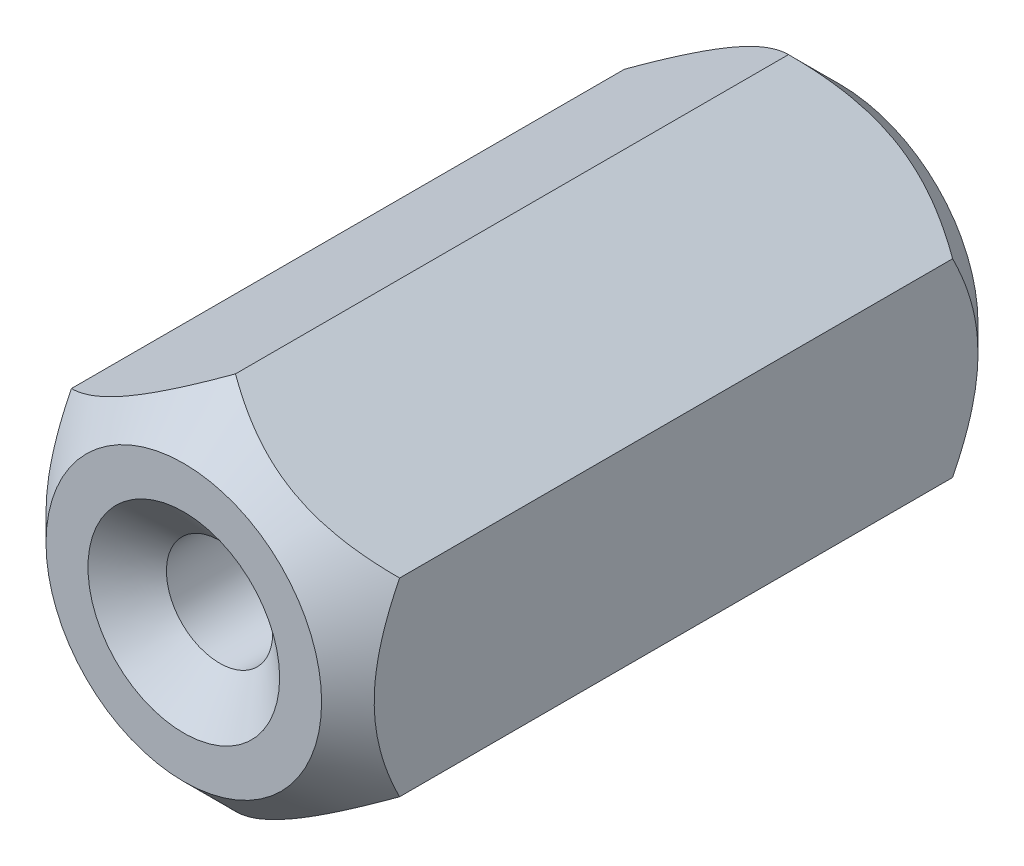
ISO-10303-21;
HEADER;
FILE_DESCRIPTION(('STEP AP214'),'2;1');
FILE_NAME('part.step','',(''),(''),'','','');
FILE_SCHEMA(('AUTOMOTIVE_DESIGN { 1 0 10303 214 1 1 1 1 }'));
ENDSEC;
DATA;
#1=APPLICATION_CONTEXT('core data for automotive mechanical design processes');
#2=APPLICATION_PROTOCOL_DEFINITION('international standard','automotive_design',2000,#1);
#3=PRODUCT_CONTEXT('',#1,'mechanical');
#4=PRODUCT('Part','Part','',(#3));
#5=PRODUCT_RELATED_PRODUCT_CATEGORY('part','',(#4));
#6=PRODUCT_DEFINITION_FORMATION('','',#4);
#7=PRODUCT_DEFINITION_CONTEXT('part definition',#1,'design');
#8=PRODUCT_DEFINITION('design','',#6,#7);
#9=PRODUCT_DEFINITION_SHAPE('','',#8);
#10=(LENGTH_UNIT() NAMED_UNIT(*) SI_UNIT(.MILLI.,.METRE.));
#11=(NAMED_UNIT(*) PLANE_ANGLE_UNIT() SI_UNIT($,.RADIAN.));
#12=(NAMED_UNIT(*) SI_UNIT($,.STERADIAN.) SOLID_ANGLE_UNIT());
#13=UNCERTAINTY_MEASURE_WITH_UNIT(LENGTH_MEASURE(1.E-05),#10,'distance_accuracy_value','');
#14=(GEOMETRIC_REPRESENTATION_CONTEXT(3) GLOBAL_UNCERTAINTY_ASSIGNED_CONTEXT((#13)) GLOBAL_UNIT_ASSIGNED_CONTEXT((#10,
#11,#12)) REPRESENTATION_CONTEXT('',''));
#15=CARTESIAN_POINT('',(0.,0.,0.));
#16=DIRECTION('',(0.,0.,1.));
#17=DIRECTION('',(1.,0.,0.));
#18=AXIS2_PLACEMENT_3D('',#15,#16,#17);
#19=CARTESIAN_POINT('',(0.,-3.66617420935412,-6.35));
#20=DIRECTION('',(0.5,-0.866025403784439,0.));
#21=DIRECTION('',(0.866025403784439,0.5,0.));
#22=AXIS2_PLACEMENT_3D('',#19,#20,#21);
#23=PLANE('',#22);
#24=CARTESIAN_POINT('',(3.1752,-1.83297163462322,-5.34988452449106));
#25=CARTESIAN_POINT('',(3.06606165005017,-1.89598269034567,-5.41284101630822));
#26=CARTESIAN_POINT('',(2.95509837192205,-1.9600473688431,-5.47209989576525));
#27=CARTESIAN_POINT('',(2.72883215365405,-2.09068223086865,-5.58060134426944));
#28=CARTESIAN_POINT('',(2.61350769674773,-2.15726483710766,-5.62978354606129));
#29=CARTESIAN_POINT('',(2.38096147751937,-2.29152545937819,-5.71403354112599));
#30=CARTESIAN_POINT('',(2.26379893371885,-2.35916928558036,-5.74931308550055));
#31=CARTESIAN_POINT('',(2.02689455535371,-2.49594609220167,-5.80366842986518));
#32=CARTESIAN_POINT('',(1.90715995735644,-2.56507489458671,-5.82278480247036));
#33=CARTESIAN_POINT('',(1.70080208124841,-2.68421566990708,-5.84003286937675));
#34=CARTESIAN_POINT('',(1.61444529227084,-2.73407378526963,-5.84258606638617));
#35=CARTESIAN_POINT('',(1.44187218347527,-2.83370891608764,-5.83828372687673));
#36=CARTESIAN_POINT('',(1.35565592350718,-2.88348589698874,-5.83142489197855));
#37=CARTESIAN_POINT('',(1.18404020841286,-2.98256827629562,-5.80869011669629));
#38=CARTESIAN_POINT('',(1.09864177574671,-3.03187308438379,-5.79280409031271));
#39=CARTESIAN_POINT('',(0.929311596694509,-3.12963590884151,-5.75288201600204));
#40=CARTESIAN_POINT('',(0.845379738380234,-3.17809398983284,-5.72884659291482));
#41=CARTESIAN_POINT('',(0.696376420715867,-3.26412109539651,-5.67939476558282));
#42=CARTESIAN_POINT('',(0.630975148808252,-3.30188053733772,-5.655278280699));
#43=CARTESIAN_POINT('',(0.50134674979488,-3.37672152840271,-5.60315853286284));
#44=CARTESIAN_POINT('',(0.437119658558265,-3.41380305681743,-5.57515515139647));
#45=CARTESIAN_POINT('',(0.310041965487392,-3.4871713971199,-5.51588943445548));
#46=CARTESIAN_POINT('',(0.247187749251269,-3.52346029578353,-5.48463734664579));
#47=CARTESIAN_POINT('',(0.122643379151904,-3.59536602138645,-5.41928465560806));
#48=CARTESIAN_POINT('',(0.0609525390212889,-3.63098324454239,-5.38518580048145));
#49=CARTESIAN_POINT('',(-0.000200000000000083,-3.66628967940796,-5.34988452449106));
#50=B_SPLINE_CURVE_WITH_KNOTS('',3,(#24,#25,#26,#27,#28,#29,#30,#31,#32,#33,#34,#35,#36,#37,#38,
#39,#40,#41,#42,#43,#44,#45,#46,#47,#48,#49),.UNSPECIFIED.,.F.,.F.,(4,2,2,2,2,2,2,2,2,2,2,2,4),
(0.,0.422910572436809,0.848285055427811,1.26690402276128,1.68446903107507,1.98329272958353,
2.28222117546891,2.58148426995467,2.88072442418454,3.11844134429547,3.35616551414406,
3.59316134346767,3.83001269744429),.UNSPECIFIED.);
#51=CARTESIAN_POINT('',(3.175,-1.83308710467706,-5.35));
#52=VERTEX_POINT('',#51);
#53=CARTESIAN_POINT('',(0.,-3.66617420935412,-5.35));
#54=VERTEX_POINT('',#53);
#55=EDGE_CURVE('E197',#52,#54,#50,.T.);
#56=ORIENTED_EDGE('',*,*,#55,.F.);
#57=DIRECTION('',(0.,0.,1.));
#58=VECTOR('',#57,1.);
#59=CARTESIAN_POINT('',(3.175,-1.83308710467706,-6.35));
#60=LINE('',#59,#58);
#61=CARTESIAN_POINT('',(3.175,-1.83308710467706,5.35));
#62=VERTEX_POINT('',#61);
#63=EDGE_CURVE('E38',#52,#62,#60,.T.);
#64=ORIENTED_EDGE('',*,*,#63,.T.);
#65=CARTESIAN_POINT('',(-0.000200000000000596,-3.66628967940796,5.34988452449106));
#66=CARTESIAN_POINT('',(0.108938349949826,-3.60327862368552,5.41284101630822));
#67=CARTESIAN_POINT('',(0.219901628077946,-3.53921394518808,5.47209989576525));
#68=CARTESIAN_POINT('',(0.446167846345949,-3.40857908316253,5.58060134426944));
#69=CARTESIAN_POINT('',(0.561492303252266,-3.34199647692352,5.62978354606129));
#70=CARTESIAN_POINT('',(0.79403852248063,-3.207735854653,5.714033541126));
#71=CARTESIAN_POINT('',(0.911201066281155,-3.14009202845082,5.74931308550055));
#72=CARTESIAN_POINT('',(1.14810544464629,-3.00331522182951,5.80366842986518));
#73=CARTESIAN_POINT('',(1.26784004264356,-2.93418641944448,5.82278480247036));
#74=CARTESIAN_POINT('',(1.47419791875159,-2.81504564412411,5.84003286937675));
#75=CARTESIAN_POINT('',(1.56055470772916,-2.76518752876155,5.84258606638617));
#76=CARTESIAN_POINT('',(1.73312781652473,-2.66555239794354,5.83828372687673));
#77=CARTESIAN_POINT('',(1.81934407649282,-2.61577541704245,5.83142489197855));
#78=CARTESIAN_POINT('',(1.99095979158714,-2.51669303773557,5.80869011669629));
#79=CARTESIAN_POINT('',(2.07635822425329,-2.46738822964739,5.79280409031271));
#80=CARTESIAN_POINT('',(2.24568840330549,-2.36962540518968,5.75288201600204));
#81=CARTESIAN_POINT('',(2.32962026161977,-2.32116732419835,5.72884659291482));
#82=CARTESIAN_POINT('',(2.47862357928413,-2.23514021863468,5.67939476558282));
#83=CARTESIAN_POINT('',(2.54402485119175,-2.19738077669347,5.655278280699));
#84=CARTESIAN_POINT('',(2.67365325020512,-2.12253978562848,5.60315853286284));
#85=CARTESIAN_POINT('',(2.73788034144173,-2.08545825721375,5.57515515139647));
#86=CARTESIAN_POINT('',(2.86495803451261,-2.01208991691129,5.51588943445548));
#87=CARTESIAN_POINT('',(2.92781225074873,-1.97580101824766,5.48463734664579));
#88=CARTESIAN_POINT('',(3.0523566208481,-1.90389529264474,5.41928465560806));
#89=CARTESIAN_POINT('',(3.11404746097871,-1.8682780694888,5.38518580048145));
#90=CARTESIAN_POINT('',(3.1752,-1.83297163462322,5.34988452449105));
#91=B_SPLINE_CURVE_WITH_KNOTS('',3,(#65,#66,#67,#68,#69,#70,#71,#72,#73,#74,#75,#76,#77,#78,#79,
#80,#81,#82,#83,#84,#85,#86,#87,#88,#89,#90),.UNSPECIFIED.,.F.,.F.,(4,2,2,2,2,2,2,2,2,2,2,2,4),
(0.,0.422910572436811,0.848285055427812,1.26690402276128,1.68446903107507,1.98329272958353,
2.28222117546892,2.58148426995467,2.88072442418454,3.11844134429548,3.35616551414406,
3.59316134346767,3.83001269744429),.UNSPECIFIED.);
#92=CARTESIAN_POINT('',(0.,-3.66617420935412,5.35));
#93=VERTEX_POINT('',#92);
#94=EDGE_CURVE('E118',#93,#62,#91,.T.);
#95=ORIENTED_EDGE('',*,*,#94,.F.);
#96=DIRECTION('',(0.,0.,1.));
#97=VECTOR('',#96,1.);
#98=CARTESIAN_POINT('',(0.,-3.66617420935412,-6.35));
#99=LINE('',#98,#97);
#100=EDGE_CURVE('E11',#54,#93,#99,.T.);
#101=ORIENTED_EDGE('',*,*,#100,.F.);
#102=EDGE_LOOP('',(#56,#64,#95,#101));
#103=FACE_BOUND('',#102,.T.);
#104=ADVANCED_FACE('F34',(#103),#23,.T.);
#105=CARTESIAN_POINT('',(-3.175,-1.83308710467706,-6.35));
#106=DIRECTION('',(-0.5,-0.866025403784439,0.));
#107=DIRECTION('',(0.866025403784439,-0.5,0.));
#108=AXIS2_PLACEMENT_3D('',#105,#106,#107);
#109=PLANE('',#108);
#110=CARTESIAN_POINT('',(0.000199999999999404,-3.66628967940796,-5.34988452449106));
#111=CARTESIAN_POINT('',(-0.108938349949827,-3.60327862368552,-5.41284101630822));
#112=CARTESIAN_POINT('',(-0.219901628077947,-3.53921394518808,-5.47209989576526));
#113=CARTESIAN_POINT('',(-0.44616784634595,-3.40857908316253,-5.58060134426944));
#114=CARTESIAN_POINT('',(-0.561492303252266,-3.34199647692352,-5.62978354606129));
#115=CARTESIAN_POINT('',(-0.794038522480631,-3.207735854653,-5.71403354112599));
#116=CARTESIAN_POINT('',(-0.911201066281155,-3.14009202845082,-5.74931308550055));
#117=CARTESIAN_POINT('',(-1.14810544464629,-3.00331522182951,-5.80366842986518));
#118=CARTESIAN_POINT('',(-1.26784004264356,-2.93418641944448,-5.82278480247036));
#119=CARTESIAN_POINT('',(-1.47419791875159,-2.81504564412411,-5.84003286937675));
#120=CARTESIAN_POINT('',(-1.56055470772916,-2.76518752876155,-5.84258606638617));
#121=CARTESIAN_POINT('',(-1.73312781652473,-2.66555239794354,-5.83828372687673));
#122=CARTESIAN_POINT('',(-1.81934407649282,-2.61577541704245,-5.83142489197855));
#123=CARTESIAN_POINT('',(-1.99095979158714,-2.51669303773556,-5.80869011669629));
#124=CARTESIAN_POINT('',(-2.07635822425329,-2.46738822964739,-5.79280409031272));
#125=CARTESIAN_POINT('',(-2.24568840330549,-2.36962540518968,-5.75288201600204));
#126=CARTESIAN_POINT('',(-2.32962026161977,-2.32116732419835,-5.72884659291482));
#127=CARTESIAN_POINT('',(-2.47862357928413,-2.23514021863468,-5.67939476558283));
#128=CARTESIAN_POINT('',(-2.54402485119175,-2.19738077669347,-5.655278280699));
#129=CARTESIAN_POINT('',(-2.67365325020512,-2.12253978562848,-5.60315853286284));
#130=CARTESIAN_POINT('',(-2.73788034144173,-2.08545825721375,-5.57515515139647));
#131=CARTESIAN_POINT('',(-2.86495803451261,-2.01208991691129,-5.51588943445549));
#132=CARTESIAN_POINT('',(-2.92781225074873,-1.97580101824766,-5.48463734664579));
#133=CARTESIAN_POINT('',(-3.0523566208481,-1.90389529264474,-5.41928465560807));
#134=CARTESIAN_POINT('',(-3.11404746097871,-1.86827806948879,-5.38518580048146));
#135=CARTESIAN_POINT('',(-3.1752,-1.83297163462322,-5.34988452449106));
#136=B_SPLINE_CURVE_WITH_KNOTS('',3,(#110,#111,#112,#113,#114,#115,#116,#117,#118,#119,#120,
#121,#122,#123,#124,#125,#126,#127,#128,#129,#130,#131,#132,#133,#134,#135),.UNSPECIFIED.,.F.,
.F.,(4,2,2,2,2,2,2,2,2,2,2,2,4),(0.,0.42291057243681,0.848285055427812,1.26690402276128,
1.68446903107507,1.98329272958353,2.28222117546892,2.58148426995467,2.88072442418454,
3.11844134429547,3.35616551414406,3.59316134346767,3.83001269744429),.UNSPECIFIED.);
#137=CARTESIAN_POINT('',(-3.175,-1.83308710467706,-5.35));
#138=VERTEX_POINT('',#137);
#139=EDGE_CURVE('E93',#54,#138,#136,.T.);
#140=ORIENTED_EDGE('',*,*,#139,.F.);
#141=ORIENTED_EDGE('',*,*,#100,.T.);
#142=CARTESIAN_POINT('',(-3.1752,-1.83297163462322,5.34988452449106));
#143=CARTESIAN_POINT('',(-3.06606165005017,-1.89598269034567,5.41284101630822));
#144=CARTESIAN_POINT('',(-2.95509837192205,-1.9600473688431,5.47209989576525));
#145=CARTESIAN_POINT('',(-2.72883215365405,-2.09068223086865,5.58060134426944));
#146=CARTESIAN_POINT('',(-2.61350769674773,-2.15726483710766,5.62978354606129));
#147=CARTESIAN_POINT('',(-2.38096147751937,-2.29152545937819,5.714033541126));
#148=CARTESIAN_POINT('',(-2.26379893371885,-2.35916928558036,5.74931308550055));
#149=CARTESIAN_POINT('',(-2.02689455535372,-2.49594609220167,5.80366842986518));
#150=CARTESIAN_POINT('',(-1.90715995735644,-2.56507489458671,5.82278480247036));
#151=CARTESIAN_POINT('',(-1.70080208124841,-2.68421566990708,5.84003286937675));
#152=CARTESIAN_POINT('',(-1.61444529227084,-2.73407378526963,5.84258606638617));
#153=CARTESIAN_POINT('',(-1.44187218347528,-2.83370891608764,5.83828372687673));
#154=CARTESIAN_POINT('',(-1.35565592350719,-2.88348589698874,5.83142489197855));
#155=CARTESIAN_POINT('',(-1.18404020841286,-2.98256827629562,5.80869011669629));
#156=CARTESIAN_POINT('',(-1.09864177574671,-3.03187308438379,5.79280409031272));
#157=CARTESIAN_POINT('',(-0.929311596694513,-3.12963590884151,5.75288201600204));
#158=CARTESIAN_POINT('',(-0.845379738380237,-3.17809398983284,5.72884659291482));
#159=CARTESIAN_POINT('',(-0.696376420715871,-3.26412109539651,5.67939476558283));
#160=CARTESIAN_POINT('',(-0.630975148808255,-3.30188053733771,5.655278280699));
#161=CARTESIAN_POINT('',(-0.501346749794882,-3.3767215284027,5.60315853286284));
#162=CARTESIAN_POINT('',(-0.437119658558267,-3.41380305681743,5.57515515139647));
#163=CARTESIAN_POINT('',(-0.310041965487393,-3.4871713971199,5.51588943445549));
#164=CARTESIAN_POINT('',(-0.247187749251271,-3.52346029578352,5.48463734664579));
#165=CARTESIAN_POINT('',(-0.122643379151905,-3.59536602138645,5.41928465560806));
#166=CARTESIAN_POINT('',(-0.0609525390212896,-3.63098324454239,5.38518580048145));
#167=CARTESIAN_POINT('',(0.000199999999999347,-3.66628967940796,5.34988452449106));
#168=B_SPLINE_CURVE_WITH_KNOTS('',3,(#142,#143,#144,#145,#146,#147,#148,#149,#150,#151,#152,
#153,#154,#155,#156,#157,#158,#159,#160,#161,#162,#163,#164,#165,#166,#167),.UNSPECIFIED.,.F.,
.F.,(4,2,2,2,2,2,2,2,2,2,2,2,4),(0.,0.422910572436809,0.84828505542781,1.26690402276128,
1.68446903107507,1.98329272958352,2.28222117546891,2.58148426995467,2.88072442418453,
3.11844134429547,3.35616551414406,3.59316134346767,3.83001269744429),.UNSPECIFIED.);
#169=CARTESIAN_POINT('',(-3.175,-1.83308710467706,5.35));
#170=VERTEX_POINT('',#169);
#171=EDGE_CURVE('E119',#170,#93,#168,.T.);
#172=ORIENTED_EDGE('',*,*,#171,.F.);
#173=DIRECTION('',(0.,0.,1.));
#174=VECTOR('',#173,1.);
#175=CARTESIAN_POINT('',(-3.175,-1.83308710467706,-6.35));
#176=LINE('',#175,#174);
#177=EDGE_CURVE('E43',#138,#170,#176,.T.);
#178=ORIENTED_EDGE('',*,*,#177,.F.);
#179=EDGE_LOOP('',(#140,#141,#172,#178));
#180=FACE_BOUND('',#179,.T.);
#181=ADVANCED_FACE('F178',(#180),#109,.T.);
#182=CARTESIAN_POINT('',(-3.175,1.83308710467706,-6.35));
#183=DIRECTION('',(-1.,0.,0.));
#184=DIRECTION('',(0.,-1.,0.));
#185=AXIS2_PLACEMENT_3D('',#182,#183,#184);
#186=PLANE('',#185);
#187=CARTESIAN_POINT('',(-3.175,-3.62314366162436,-4.19872727215091));
#188=CARTESIAN_POINT('',(-3.175,-3.53477477471413,-4.26517330066197));
#189=CARTESIAN_POINT('',(-3.175,-3.44590747401783,-4.33096732929088));
#190=CARTESIAN_POINT('',(-3.175,-3.26698086109358,-4.46096065674581));
#191=CARTESIAN_POINT('',(-3.175,-3.17692125186334,-4.52515954631578));
#192=CARTESIAN_POINT('',(-3.175,-2.9947562299698,-4.65212801376402));
#193=CARTESIAN_POINT('',(-3.175,-2.90264037042889,-4.71488265440275));
#194=CARTESIAN_POINT('',(-3.175,-2.71683951537136,-4.8380168325571));
#195=CARTESIAN_POINT('',(-3.175,-2.62315463201829,-4.89839653882316));
#196=CARTESIAN_POINT('',(-3.175,-2.42867521304995,-5.01955311497214));
#197=CARTESIAN_POINT('',(-3.175,-2.327776197965,-5.08016312895682));
#198=CARTESIAN_POINT('',(-3.175,-2.1236266416231,-5.19734891241029));
#199=CARTESIAN_POINT('',(-3.175,-2.02037573570296,-5.25392405057173));
#200=CARTESIAN_POINT('',(-3.175,-1.81153946353305,-5.36181638181168));
#201=CARTESIAN_POINT('',(-3.175,-1.70596214797143,-5.41314903574252));
#202=CARTESIAN_POINT('',(-3.175,-1.49194968831593,-5.50940753599678));
#203=CARTESIAN_POINT('',(-3.175,-1.38351585328126,-5.55433625855787));
#204=CARTESIAN_POINT('',(-3.175,-1.17206906194383,-5.63305402653428));
#205=CARTESIAN_POINT('',(-3.175,-1.06927808219159,-5.6674331189904));
#206=CARTESIAN_POINT('',(-3.175,-0.861249989752693,-5.72794018821902));
#207=CARTESIAN_POINT('',(-3.175,-0.756012706347597,-5.75406758726936));
#208=CARTESIAN_POINT('',(-3.175,-0.545455116385145,-5.79628154980003));
#209=CARTESIAN_POINT('',(-3.175,-0.440169465308187,-5.81253816718227));
#210=CARTESIAN_POINT('',(-3.175,-0.228508692793317,-5.83470019179704));
#211=CARTESIAN_POINT('',(-3.175,-0.122133754622792,-5.84060731241113));
#212=CARTESIAN_POINT('',(-3.175,0.0869577968377134,-5.84164473816365));
#213=CARTESIAN_POINT('',(-3.175,0.189672720284837,-5.83714340706931));
#214=CARTESIAN_POINT('',(-3.175,0.394206632826209,-5.81841780352249));
#215=CARTESIAN_POINT('',(-3.175,0.496025532914315,-5.80419257595037));
#216=CARTESIAN_POINT('',(-3.175,0.699751411908735,-5.76654774602645));
#217=CARTESIAN_POINT('',(-3.175,0.80162922915897,-5.7429728022883));
#218=CARTESIAN_POINT('',(-3.175,1.00316901022372,-5.68787603830061));
#219=CARTESIAN_POINT('',(-3.175,1.10283116972946,-5.65635492293116));
#220=CARTESIAN_POINT('',(-3.175,1.30972972723242,-5.583139745003));
#221=CARTESIAN_POINT('',(-3.175,1.41671377003006,-5.54073954984725));
#222=CARTESIAN_POINT('',(-3.175,1.62788222750015,-5.4494455092361));
#223=CARTESIAN_POINT('',(-3.175,1.73206568079257,-5.40054946728032));
#224=CARTESIAN_POINT('',(-3.175,1.93816752656033,-5.2974201972936));
#225=CARTESIAN_POINT('',(-3.175,2.04007726416977,-5.24316981162604));
#226=CARTESIAN_POINT('',(-3.175,2.24154914453307,-5.13053481703511));
#227=CARTESIAN_POINT('',(-3.175,2.34111165997837,-5.07215087041164));
#228=CARTESIAN_POINT('',(-3.175,2.53328789139579,-4.95505822864378));
#229=CARTESIAN_POINT('',(-3.175,2.62600050272272,-4.89651098750221));
#230=CARTESIAN_POINT('',(-3.175,2.80983442239984,-4.77696182904577));
#231=CARTESIAN_POINT('',(-3.175,2.90095560921207,-4.71595972541707));
#232=CARTESIAN_POINT('',(-3.175,3.08107470813498,-4.59244540123562));
#233=CARTESIAN_POINT('',(-3.175,3.1700838687153,-4.52994952545103));
#234=CARTESIAN_POINT('',(-3.175,3.34688695470738,-4.40331054967444));
#235=CARTESIAN_POINT('',(-3.175,3.43468120733686,-4.33916790704841));
#236=CARTESIAN_POINT('',(-3.175,3.52196693533842,-4.27435218679602));
#237=B_SPLINE_CURVE_WITH_KNOTS('',3,(#187,#188,#189,#190,#191,#192,#193,#194,#195,#196,#197,
#198,#199,#200,#201,#202,#203,#204,#205,#206,#207,#208,#209,#210,#211,#212,#213,#214,#215,#216,
#217,#218,#219,#220,#221,#222,#223,#224,#225,#226,#227,#228,#229,#230,#231,#232,#233,#234,#235,
#236),.UNSPECIFIED.,.F.,.F.,(4,2,2,2,2,2,2,2,2,2,2,2,2,2,2,2,2,2,2,2,2,2,2,2,4),(0.,
0.331695086033258,0.663474412411204,0.997825593478522,1.33215297421855,1.68518935827853,
2.03828085871132,2.39029899374214,2.74215852308448,3.06703502033416,3.39193425797894,
3.71106436530982,4.03014163496714,4.33810010599997,4.64608883028139,4.9594247376372,
5.27273285971666,5.6177025492793,5.96278918493366,6.30901993384334,6.65519533292016,
6.98410375942931,7.31303719597191,7.63929174244195,7.96545663622253),.UNSPECIFIED.);
#238=CARTESIAN_POINT('',(-3.175,1.83308710467706,-5.35));
#239=VERTEX_POINT('',#238);
#240=EDGE_CURVE('E87',#138,#239,#237,.T.);
#241=ORIENTED_EDGE('',*,*,#240,.F.);
#242=ORIENTED_EDGE('',*,*,#177,.T.);
#243=CARTESIAN_POINT('',(-3.175,-3.62314366162436,4.19872727215091));
#244=CARTESIAN_POINT('',(-3.175,-3.53477477471413,4.26517330066197));
#245=CARTESIAN_POINT('',(-3.175,-3.44590747401783,4.33096732929088));
#246=CARTESIAN_POINT('',(-3.175,-3.26698086109358,4.46096065674581));
#247=CARTESIAN_POINT('',(-3.175,-3.17692125186334,4.52515954631578));
#248=CARTESIAN_POINT('',(-3.175,-2.9947562299698,4.65212801376402));
#249=CARTESIAN_POINT('',(-3.175,-2.90264037042889,4.71488265440275));
#250=CARTESIAN_POINT('',(-3.175,-2.71683951537136,4.8380168325571));
#251=CARTESIAN_POINT('',(-3.175,-2.62315463201829,4.89839653882316));
#252=CARTESIAN_POINT('',(-3.175,-2.42867521304995,5.01955311497214));
#253=CARTESIAN_POINT('',(-3.175,-2.327776197965,5.08016312895682));
#254=CARTESIAN_POINT('',(-3.175,-2.1236266416231,5.19734891241029));
#255=CARTESIAN_POINT('',(-3.175,-2.02037573570296,5.25392405057173));
#256=CARTESIAN_POINT('',(-3.175,-1.81153946353305,5.36181638181168));
#257=CARTESIAN_POINT('',(-3.175,-1.70596214797143,5.41314903574252));
#258=CARTESIAN_POINT('',(-3.175,-1.49194968831593,5.50940753599678));
#259=CARTESIAN_POINT('',(-3.175,-1.38351585328126,5.55433625855787));
#260=CARTESIAN_POINT('',(-3.175,-1.17206906194383,5.63305402653428));
#261=CARTESIAN_POINT('',(-3.175,-1.06927808219159,5.6674331189904));
#262=CARTESIAN_POINT('',(-3.175,-0.861249989752693,5.72794018821902));
#263=CARTESIAN_POINT('',(-3.175,-0.756012706347597,5.75406758726936));
#264=CARTESIAN_POINT('',(-3.175,-0.545455116385145,5.79628154980003));
#265=CARTESIAN_POINT('',(-3.175,-0.440169465308187,5.81253816718227));
#266=CARTESIAN_POINT('',(-3.175,-0.228508692793317,5.83470019179704));
#267=CARTESIAN_POINT('',(-3.175,-0.122133754622792,5.84060731241113));
#268=CARTESIAN_POINT('',(-3.175,0.0869577968377134,5.84164473816365));
#269=CARTESIAN_POINT('',(-3.175,0.189672720284837,5.83714340706931));
#270=CARTESIAN_POINT('',(-3.175,0.394206632826209,5.81841780352249));
#271=CARTESIAN_POINT('',(-3.175,0.496025532914315,5.80419257595037));
#272=CARTESIAN_POINT('',(-3.175,0.699751411908735,5.76654774602645));
#273=CARTESIAN_POINT('',(-3.175,0.80162922915897,5.7429728022883));
#274=CARTESIAN_POINT('',(-3.175,1.00316901022372,5.68787603830061));
#275=CARTESIAN_POINT('',(-3.175,1.10283116972946,5.65635492293116));
#276=CARTESIAN_POINT('',(-3.175,1.30972972723242,5.583139745003));
#277=CARTESIAN_POINT('',(-3.175,1.41671377003006,5.54073954984725));
#278=CARTESIAN_POINT('',(-3.175,1.62788222750015,5.4494455092361));
#279=CARTESIAN_POINT('',(-3.175,1.73206568079257,5.40054946728032));
#280=CARTESIAN_POINT('',(-3.175,1.93816752656033,5.2974201972936));
#281=CARTESIAN_POINT('',(-3.175,2.04007726416977,5.24316981162604));
#282=CARTESIAN_POINT('',(-3.175,2.24154914453307,5.13053481703511));
#283=CARTESIAN_POINT('',(-3.175,2.34111165997837,5.07215087041164));
#284=CARTESIAN_POINT('',(-3.175,2.53328789139579,4.95505822864378));
#285=CARTESIAN_POINT('',(-3.175,2.62600050272272,4.89651098750221));
#286=CARTESIAN_POINT('',(-3.175,2.80983442239984,4.77696182904577));
#287=CARTESIAN_POINT('',(-3.175,2.90095560921207,4.71595972541707));
#288=CARTESIAN_POINT('',(-3.175,3.08107470813498,4.59244540123562));
#289=CARTESIAN_POINT('',(-3.175,3.1700838687153,4.52994952545103));
#290=CARTESIAN_POINT('',(-3.175,3.34688695470738,4.40331054967444));
#291=CARTESIAN_POINT('',(-3.175,3.43468120733686,4.33916790704841));
#292=CARTESIAN_POINT('',(-3.175,3.52196693533842,4.27435218679602));
#293=B_SPLINE_CURVE_WITH_KNOTS('',3,(#243,#244,#245,#246,#247,#248,#249,#250,#251,#252,#253,
#254,#255,#256,#257,#258,#259,#260,#261,#262,#263,#264,#265,#266,#267,#268,#269,#270,#271,#272,
#273,#274,#275,#276,#277,#278,#279,#280,#281,#282,#283,#284,#285,#286,#287,#288,#289,#290,#291,
#292),.UNSPECIFIED.,.F.,.F.,(4,2,2,2,2,2,2,2,2,2,2,2,2,2,2,2,2,2,2,2,2,2,2,2,4),(0.,
0.331695086033258,0.663474412411204,0.997825593478522,1.33215297421855,1.68518935827853,
2.03828085871132,2.39029899374214,2.74215852308448,3.06703502033416,3.39193425797894,
3.71106436530982,4.03014163496714,4.33810010599997,4.64608883028139,4.9594247376372,
5.27273285971666,5.6177025492793,5.96278918493366,6.30901993384334,6.65519533292016,
6.98410375942931,7.31303719597191,7.63929174244195,7.96545663622253),.UNSPECIFIED.);
#294=CARTESIAN_POINT('',(-3.175,1.83308710467706,5.35));
#295=VERTEX_POINT('',#294);
#296=EDGE_CURVE('E109',#295,#170,#293,.F.);
#297=ORIENTED_EDGE('',*,*,#296,.F.);
#298=DIRECTION('',(0.,0.,1.));
#299=VECTOR('',#298,1.);
#300=CARTESIAN_POINT('',(-3.175,1.83308710467706,-6.35));
#301=LINE('',#300,#299);
#302=EDGE_CURVE('E102',#239,#295,#301,.T.);
#303=ORIENTED_EDGE('',*,*,#302,.F.);
#304=EDGE_LOOP('',(#241,#242,#297,#303));
#305=FACE_BOUND('',#304,.T.);
#306=ADVANCED_FACE('F107',(#305),#186,.T.);
#307=CARTESIAN_POINT('',(0.,3.66617420935412,-6.35));
#308=DIRECTION('',(-0.5,0.866025403784439,0.));
#309=DIRECTION('',(-0.866025403784439,-0.5,0.));
#310=AXIS2_PLACEMENT_3D('',#307,#308,#309);
#311=PLANE('',#310);
#312=CARTESIAN_POINT('',(-3.1752,1.83297163462323,-5.34988452449106));
#313=CARTESIAN_POINT('',(-3.06606165005017,1.89598269034567,-5.41284101630822));
#314=CARTESIAN_POINT('',(-2.95509837192205,1.9600473688431,-5.47209989576525));
#315=CARTESIAN_POINT('',(-2.72883215365405,2.09068223086865,-5.58060134426944));
#316=CARTESIAN_POINT('',(-2.61350769674773,2.15726483710766,-5.62978354606129));
#317=CARTESIAN_POINT('',(-2.38096147751937,2.29152545937819,-5.71403354112599));
#318=CARTESIAN_POINT('',(-2.26379893371885,2.35916928558036,-5.74931308550055));
#319=CARTESIAN_POINT('',(-2.02689455535371,2.49594609220167,-5.80366842986518));
#320=CARTESIAN_POINT('',(-1.90715995735644,2.56507489458671,-5.82278480247036));
#321=CARTESIAN_POINT('',(-1.70080208124841,2.68421566990708,-5.84003286937675));
#322=CARTESIAN_POINT('',(-1.61444529227084,2.73407378526963,-5.84258606638617));
#323=CARTESIAN_POINT('',(-1.44187218347527,2.83370891608764,-5.83828372687673));
#324=CARTESIAN_POINT('',(-1.35565592350719,2.88348589698874,-5.83142489197855));
#325=CARTESIAN_POINT('',(-1.18404020841286,2.98256827629562,-5.80869011669629));
#326=CARTESIAN_POINT('',(-1.09864177574671,3.03187308438379,-5.79280409031271));
#327=CARTESIAN_POINT('',(-0.929311596694511,3.12963590884151,-5.75288201600204));
#328=CARTESIAN_POINT('',(-0.845379738380236,3.17809398983284,-5.72884659291482));
#329=CARTESIAN_POINT('',(-0.696376420715869,3.26412109539651,-5.67939476558283));
#330=CARTESIAN_POINT('',(-0.630975148808253,3.30188053733771,-5.655278280699));
#331=CARTESIAN_POINT('',(-0.501346749794881,3.3767215284027,-5.60315853286284));
#332=CARTESIAN_POINT('',(-0.437119658558266,3.41380305681743,-5.57515515139647));
#333=CARTESIAN_POINT('',(-0.310041965487392,3.4871713971199,-5.51588943445549));
#334=CARTESIAN_POINT('',(-0.247187749251269,3.52346029578352,-5.48463734664579));
#335=CARTESIAN_POINT('',(-0.122643379151903,3.59536602138645,-5.41928465560806));
#336=CARTESIAN_POINT('',(-0.0609525390212879,3.63098324454239,-5.38518580048145));
#337=CARTESIAN_POINT('',(0.000200000000001174,3.66628967940796,-5.34988452449106));
#338=B_SPLINE_CURVE_WITH_KNOTS('',3,(#312,#313,#314,#315,#316,#317,#318,#319,#320,#321,#322,
#323,#324,#325,#326,#327,#328,#329,#330,#331,#332,#333,#334,#335,#336,#337),.UNSPECIFIED.,.F.,
.F.,(4,2,2,2,2,2,2,2,2,2,2,2,4),(0.,0.422910572436809,0.84828505542781,1.26690402276128,
1.68446903107507,1.98329272958352,2.28222117546891,2.58148426995467,2.88072442418453,
3.11844134429547,3.35616551414406,3.59316134346767,3.83001269744429),.UNSPECIFIED.);
#339=CARTESIAN_POINT('',(0.,3.66617420935412,-5.35));
#340=VERTEX_POINT('',#339);
#341=EDGE_CURVE('E91',#239,#340,#338,.T.);
#342=ORIENTED_EDGE('',*,*,#341,.F.);
#343=ORIENTED_EDGE('',*,*,#302,.T.);
#344=CARTESIAN_POINT('',(0.000200000000001491,3.66628967940796,5.34988452449106));
#345=CARTESIAN_POINT('',(-0.108938349949825,3.60327862368552,5.41284101630822));
#346=CARTESIAN_POINT('',(-0.219901628077945,3.53921394518808,5.47209989576526));
#347=CARTESIAN_POINT('',(-0.446167846345947,3.40857908316253,5.58060134426944));
#348=CARTESIAN_POINT('',(-0.561492303252264,3.34199647692353,5.62978354606129));
#349=CARTESIAN_POINT('',(-0.794038522480629,3.207735854653,5.71403354112599));
#350=CARTESIAN_POINT('',(-0.911201066281153,3.14009202845083,5.74931308550055));
#351=CARTESIAN_POINT('',(-1.14810544464628,3.00331522182952,5.80366842986518));
#352=CARTESIAN_POINT('',(-1.26784004264356,2.93418641944448,5.82278480247036));
#353=CARTESIAN_POINT('',(-1.47419791875159,2.81504564412411,5.84003286937675));
#354=CARTESIAN_POINT('',(-1.56055470772916,2.76518752876155,5.84258606638617));
#355=CARTESIAN_POINT('',(-1.73312781652473,2.66555239794355,5.83828372687673));
#356=CARTESIAN_POINT('',(-1.81934407649281,2.61577541704245,5.83142489197855));
#357=CARTESIAN_POINT('',(-1.99095979158714,2.51669303773557,5.80869011669629));
#358=CARTESIAN_POINT('',(-2.07635822425329,2.4673882296474,5.79280409031271));
#359=CARTESIAN_POINT('',(-2.24568840330549,2.36962540518968,5.75288201600204));
#360=CARTESIAN_POINT('',(-2.32962026161976,2.32116732419835,5.72884659291482));
#361=CARTESIAN_POINT('',(-2.47862357928413,2.23514021863468,5.67939476558282));
#362=CARTESIAN_POINT('',(-2.54402485119175,2.19738077669347,5.655278280699));
#363=CARTESIAN_POINT('',(-2.67365325020512,2.12253978562848,5.60315853286284));
#364=CARTESIAN_POINT('',(-2.73788034144173,2.08545825721375,5.57515515139647));
#365=CARTESIAN_POINT('',(-2.86495803451261,2.01208991691129,5.51588943445548));
#366=CARTESIAN_POINT('',(-2.92781225074873,1.97580101824766,5.48463734664579));
#367=CARTESIAN_POINT('',(-3.0523566208481,1.90389529264474,5.41928465560806));
#368=CARTESIAN_POINT('',(-3.11404746097871,1.8682780694888,5.38518580048145));
#369=CARTESIAN_POINT('',(-3.1752,1.83297163462323,5.34988452449106));
#370=B_SPLINE_CURVE_WITH_KNOTS('',3,(#344,#345,#346,#347,#348,#349,#350,#351,#352,#353,#354,
#355,#356,#357,#358,#359,#360,#361,#362,#363,#364,#365,#366,#367,#368,#369),.UNSPECIFIED.,.F.,
.F.,(4,2,2,2,2,2,2,2,2,2,2,2,4),(0.,0.42291057243681,0.848285055427811,1.26690402276128,
1.68446903107507,1.98329272958353,2.28222117546892,2.58148426995467,2.88072442418454,
3.11844134429548,3.35616551414406,3.59316134346767,3.83001269744429),.UNSPECIFIED.);
#371=CARTESIAN_POINT('',(0.,3.66617420935412,5.35));
#372=VERTEX_POINT('',#371);
#373=EDGE_CURVE('E165',#372,#295,#370,.T.);
#374=ORIENTED_EDGE('',*,*,#373,.F.);
#375=DIRECTION('',(0.,0.,1.));
#376=VECTOR('',#375,1.);
#377=CARTESIAN_POINT('',(0.,3.66617420935412,-6.35));
#378=LINE('',#377,#376);
#379=EDGE_CURVE('E104',#340,#372,#378,.T.);
#380=ORIENTED_EDGE('',*,*,#379,.F.);
#381=EDGE_LOOP('',(#342,#343,#374,#380));
#382=FACE_BOUND('',#381,.T.);
#383=ADVANCED_FACE('F100',(#382),#311,.T.);
#384=CARTESIAN_POINT('',(3.175,1.83308710467706,-6.35));
#385=DIRECTION('',(0.5,0.866025403784438,0.));
#386=DIRECTION('',(-0.866025403784438,0.5,0.));
#387=AXIS2_PLACEMENT_3D('',#384,#385,#386);
#388=PLANE('',#387);
#389=CARTESIAN_POINT('',(-0.000199999999998509,3.66628967940796,-5.34988452449105));
#390=CARTESIAN_POINT('',(0.108938349949828,3.60327862368552,-5.41284101630822));
#391=CARTESIAN_POINT('',(0.219901628077948,3.53921394518808,-5.47209989576525));
#392=CARTESIAN_POINT('',(0.446167846345951,3.40857908316253,-5.58060134426944));
#393=CARTESIAN_POINT('',(0.561492303252268,3.34199647692352,-5.62978354606129));
#394=CARTESIAN_POINT('',(0.794038522480632,3.207735854653,-5.71403354112599));
#395=CARTESIAN_POINT('',(0.911201066281157,3.14009202845082,-5.74931308550055));
#396=CARTESIAN_POINT('',(1.14810544464629,3.00331522182951,-5.80366842986518));
#397=CARTESIAN_POINT('',(1.26784004264356,2.93418641944448,-5.82278480247036));
#398=CARTESIAN_POINT('',(1.47419791875159,2.81504564412411,-5.84003286937675));
#399=CARTESIAN_POINT('',(1.56055470772917,2.76518752876155,-5.84258606638617));
#400=CARTESIAN_POINT('',(1.73312781652473,2.66555239794354,-5.83828372687673));
#401=CARTESIAN_POINT('',(1.81934407649282,2.61577541704245,-5.83142489197855));
#402=CARTESIAN_POINT('',(1.99095979158714,2.51669303773556,-5.80869011669629));
#403=CARTESIAN_POINT('',(2.07635822425329,2.46738822964739,-5.79280409031271));
#404=CARTESIAN_POINT('',(2.24568840330549,2.36962540518968,-5.75288201600204));
#405=CARTESIAN_POINT('',(2.32962026161977,2.32116732419834,-5.72884659291482));
#406=CARTESIAN_POINT('',(2.47862357928413,2.23514021863468,-5.67939476558282));
#407=CARTESIAN_POINT('',(2.54402485119175,2.19738077669347,-5.655278280699));
#408=CARTESIAN_POINT('',(2.67365325020512,2.12253978562848,-5.60315853286284));
#409=CARTESIAN_POINT('',(2.73788034144174,2.08545825721375,-5.57515515139647));
#410=CARTESIAN_POINT('',(2.86495803451261,2.01208991691129,-5.51588943445548));
#411=CARTESIAN_POINT('',(2.92781225074873,1.97580101824766,-5.48463734664579));
#412=CARTESIAN_POINT('',(3.0523566208481,1.90389529264474,-5.41928465560806));
#413=CARTESIAN_POINT('',(3.11404746097871,1.86827806948879,-5.38518580048145));
#414=CARTESIAN_POINT('',(3.1752,1.83297163462322,-5.34988452449106));
#415=B_SPLINE_CURVE_WITH_KNOTS('',3,(#389,#390,#391,#392,#393,#394,#395,#396,#397,#398,#399,
#400,#401,#402,#403,#404,#405,#406,#407,#408,#409,#410,#411,#412,#413,#414),.UNSPECIFIED.,.F.,
.F.,(4,2,2,2,2,2,2,2,2,2,2,2,4),(0.,0.422910572436811,0.848285055427812,1.26690402276128,
1.68446903107507,1.98329272958353,2.28222117546892,2.58148426995467,2.88072442418454,
3.11844134429547,3.35616551414406,3.59316134346767,3.83001269744429),.UNSPECIFIED.);
#416=CARTESIAN_POINT('',(3.175,1.83308710467706,-5.35));
#417=VERTEX_POINT('',#416);
#418=EDGE_CURVE('E51',#340,#417,#415,.T.);
#419=ORIENTED_EDGE('',*,*,#418,.F.);
#420=ORIENTED_EDGE('',*,*,#379,.T.);
#421=CARTESIAN_POINT('',(3.1752,1.83297163462322,5.34988452449106));
#422=CARTESIAN_POINT('',(3.06606165005017,1.89598269034567,5.41284101630822));
#423=CARTESIAN_POINT('',(2.95509837192205,1.9600473688431,5.47209989576525));
#424=CARTESIAN_POINT('',(2.72883215365405,2.09068223086865,5.58060134426944));
#425=CARTESIAN_POINT('',(2.61350769674773,2.15726483710766,5.62978354606129));
#426=CARTESIAN_POINT('',(2.38096147751937,2.29152545937819,5.714033541126));
#427=CARTESIAN_POINT('',(2.26379893371885,2.35916928558036,5.74931308550055));
#428=CARTESIAN_POINT('',(2.02689455535371,2.49594609220167,5.80366842986518));
#429=CARTESIAN_POINT('',(1.90715995735644,2.56507489458671,5.82278480247036));
#430=CARTESIAN_POINT('',(1.70080208124841,2.68421566990708,5.84003286937675));
#431=CARTESIAN_POINT('',(1.61444529227084,2.73407378526963,5.84258606638617));
#432=CARTESIAN_POINT('',(1.44187218347527,2.83370891608764,5.83828372687673));
#433=CARTESIAN_POINT('',(1.35565592350719,2.88348589698874,5.83142489197855));
#434=CARTESIAN_POINT('',(1.18404020841286,2.98256827629562,5.80869011669629));
#435=CARTESIAN_POINT('',(1.09864177574671,3.03187308438379,5.79280409031271));
#436=CARTESIAN_POINT('',(0.929311596694511,3.12963590884151,5.75288201600204));
#437=CARTESIAN_POINT('',(0.845379738380236,3.17809398983284,5.72884659291482));
#438=CARTESIAN_POINT('',(0.696376420715869,3.26412109539651,5.67939476558282));
#439=CARTESIAN_POINT('',(0.630975148808254,3.30188053733771,5.655278280699));
#440=CARTESIAN_POINT('',(0.501346749794882,3.37672152840271,5.60315853286284));
#441=CARTESIAN_POINT('',(0.437119658558267,3.41380305681743,5.57515515139647));
#442=CARTESIAN_POINT('',(0.310041965487394,3.4871713971199,5.51588943445548));
#443=CARTESIAN_POINT('',(0.247187749251271,3.52346029578353,5.48463734664579));
#444=CARTESIAN_POINT('',(0.122643379151905,3.59536602138645,5.41928465560806));
#445=CARTESIAN_POINT('',(0.0609525390212904,3.63098324454239,5.38518580048145));
#446=CARTESIAN_POINT('',(-0.000199999999998456,3.66628967940796,5.34988452449105));
#447=B_SPLINE_CURVE_WITH_KNOTS('',3,(#421,#422,#423,#424,#425,#426,#427,#428,#429,#430,#431,
#432,#433,#434,#435,#436,#437,#438,#439,#440,#441,#442,#443,#444,#445,#446),.UNSPECIFIED.,.F.,
.F.,(4,2,2,2,2,2,2,2,2,2,2,2,4),(0.,0.42291057243681,0.848285055427811,1.26690402276128,
1.68446903107507,1.98329272958353,2.28222117546892,2.58148426995467,2.88072442418453,
3.11844134429547,3.35616551414406,3.59316134346767,3.83001269744429),.UNSPECIFIED.);
#448=CARTESIAN_POINT('',(3.175,1.83308710467706,5.35));
#449=VERTEX_POINT('',#448);
#450=EDGE_CURVE('E157',#449,#372,#447,.T.);
#451=ORIENTED_EDGE('',*,*,#450,.F.);
#452=DIRECTION('',(0.,0.,1.));
#453=VECTOR('',#452,1.);
#454=CARTESIAN_POINT('',(3.175,1.83308710467706,-6.35));
#455=LINE('',#454,#453);
#456=EDGE_CURVE('E112',#417,#449,#455,.T.);
#457=ORIENTED_EDGE('',*,*,#456,.F.);
#458=EDGE_LOOP('',(#419,#420,#451,#457));
#459=FACE_BOUND('',#458,.T.);
#460=ADVANCED_FACE('F215',(#459),#388,.T.);
#461=CARTESIAN_POINT('',(3.175,-1.83308710467706,-6.35));
#462=DIRECTION('',(1.,0.,0.));
#463=DIRECTION('',(0.,0.,-1.));
#464=AXIS2_PLACEMENT_3D('',#461,#462,#463);
#465=PLANE('',#464);
#466=CARTESIAN_POINT('',(3.175,-3.62314366067579,-4.19872727286431));
#467=CARTESIAN_POINT('',(3.175,-3.53477477379202,-4.26517330134793));
#468=CARTESIAN_POINT('',(3.175,-3.44590747312225,-4.33096732994944));
#469=CARTESIAN_POINT('',(3.175,-3.26698086025134,-4.46096065734972));
#470=CARTESIAN_POINT('',(3.175,-3.17692125104791,-4.52515954689244));
#471=CARTESIAN_POINT('',(3.175,-2.99475622920889,-4.65212801428601));
#472=CARTESIAN_POINT('',(3.175,-2.9026403696957,-4.71488265489732));
#473=CARTESIAN_POINT('',(3.175,-2.71683951469412,-4.83801683299725));
#474=CARTESIAN_POINT('',(3.175,-2.62315463136928,-4.89839653923633));
#475=CARTESIAN_POINT('',(3.175,-2.42867521246179,-5.0195531153292));
#476=CARTESIAN_POINT('',(3.175,-2.32777619740955,-5.08016312928487));
#477=CARTESIAN_POINT('',(3.175,-2.12362664113426,-5.19734891268168));
#478=CARTESIAN_POINT('',(3.175,-2.02037573524801,-5.25392405081547));
#479=CARTESIAN_POINT('',(3.175,-1.81153946314711,-5.3618163820024));
#480=CARTESIAN_POINT('',(3.175,-1.7059621476206,-5.41314903590788));
#481=CARTESIAN_POINT('',(3.175,-1.49194968803719,-5.5094075361146));
#482=CARTESIAN_POINT('',(3.175,-1.3835158530395,-5.55433625865351));
#483=CARTESIAN_POINT('',(3.175,-1.17206906171815,-5.63305402661309));
#484=CARTESIAN_POINT('',(3.175,-1.0692780819434,-5.66743311907037));
#485=CARTESIAN_POINT('',(3.175,-0.861249989458809,-5.72794018829673));
#486=CARTESIAN_POINT('',(3.175,-0.756012706030513,-5.75406758734365));
#487=CARTESIAN_POINT('',(3.175,-0.545455116022437,-5.79628154986223));
#488=CARTESIAN_POINT('',(3.175,-0.440169464923066,-5.81253816723595));
#489=CARTESIAN_POINT('',(3.175,-0.228508692364151,-5.83470019182863));
#490=CARTESIAN_POINT('',(3.175,-0.122133754171996,-5.84060731242916));
#491=CARTESIAN_POINT('',(3.175,0.0869577973290809,-5.84164473815083));
#492=CARTESIAN_POINT('',(3.175,0.1896727207952,-5.83714340703938));
#493=CARTESIAN_POINT('',(3.175,0.394206633372702,-5.81841780345564));
#494=CARTESIAN_POINT('',(3.175,0.496025533477941,-5.80419257586372));
#495=CARTESIAN_POINT('',(3.175,0.699751412506188,-5.76654774589823));
#496=CARTESIAN_POINT('',(3.175,0.801629229773065,-5.74297280213821));
#497=CARTESIAN_POINT('',(3.175,1.00316901086953,-5.68787603810625));
#498=CARTESIAN_POINT('',(3.175,1.10283117039033,-5.65635492271443));
#499=CARTESIAN_POINT('',(3.175,1.30972972797288,-5.5831397447221));
#500=CARTESIAN_POINT('',(3.175,1.41671377083364,-5.54073954952092));
#501=CARTESIAN_POINT('',(3.175,1.62788222842673,-5.44944550881442));
#502=CARTESIAN_POINT('',(3.175,1.73206568177903,-5.40054946680869));
#503=CARTESIAN_POINT('',(3.175,1.93816752766441,-5.29742019671909));
#504=CARTESIAN_POINT('',(3.175,2.04007726533157,-5.24316981099857));
#505=CARTESIAN_POINT('',(3.175,2.24154914580843,-5.13053481630006));
#506=CARTESIAN_POINT('',(3.175,2.34111166130958,-5.072150869622));
#507=CARTESIAN_POINT('',(3.175,2.53328789282852,-4.95505822775043));
#508=CARTESIAN_POINT('',(3.175,2.62600050420133,-4.89651098656001));
#509=CARTESIAN_POINT('',(3.175,2.80983442396953,-4.77696182800565));
#510=CARTESIAN_POINT('',(3.175,2.90095561082698,-4.71595972432788));
#511=CARTESIAN_POINT('',(3.175,3.08107470983924,-4.59244540004885));
#512=CARTESIAN_POINT('',(3.175,3.17008387046369,-4.52994952421576));
#513=CARTESIAN_POINT('',(3.175,3.34688695654375,-4.40331054834222));
#514=CARTESIAN_POINT('',(3.175,3.43468120921709,-4.33916790566774));
#515=CARTESIAN_POINT('',(3.175,3.52196693726243,-4.27435218536698));
#516=B_SPLINE_CURVE_WITH_KNOTS('',3,(#466,#467,#468,#469,#470,#471,#472,#473,#474,#475,#476,
#477,#478,#479,#480,#481,#482,#483,#484,#485,#486,#487,#488,#489,#490,#491,#492,#493,#494,#495,
#496,#497,#498,#499,#500,#501,#502,#503,#504,#505,#506,#507,#508,#509,#510,#511,#512,#513,#514,
#515),.UNSPECIFIED.,.F.,.F.,(4,2,2,2,2,2,2,2,2,2,2,2,2,2,2,2,2,2,2,2,2,2,2,2,4),(0.,
0.331695085920362,0.663474412185376,0.997825593137643,1.33215297376264,1.68518935769371,
2.03828085799751,2.39029899290042,2.74215852211506,3.06703501942959,3.3919342571391,
3.71106436453215,4.03014163425164,4.33810010534342,4.64608882968384,4.95942473710304,
5.27273285924588,5.61770254903443,5.96278918491495,6.3090199340521,6.65519533335629,
6.98410376006005,7.31303719679728,7.6392917434593,7.96545663743185),.UNSPECIFIED.);
#517=EDGE_CURVE('E211',#417,#52,#516,.F.);
#518=ORIENTED_EDGE('',*,*,#517,.F.);
#519=ORIENTED_EDGE('',*,*,#456,.T.);
#520=CARTESIAN_POINT('',(3.175,-3.62314366067579,4.19872727286431));
#521=CARTESIAN_POINT('',(3.175,-3.53477477379202,4.26517330134793));
#522=CARTESIAN_POINT('',(3.175,-3.44590747312225,4.33096732994944));
#523=CARTESIAN_POINT('',(3.175,-3.26698086025134,4.46096065734972));
#524=CARTESIAN_POINT('',(3.175,-3.17692125104791,4.52515954689244));
#525=CARTESIAN_POINT('',(3.175,-2.99475622920889,4.65212801428601));
#526=CARTESIAN_POINT('',(3.175,-2.9026403696957,4.71488265489732));
#527=CARTESIAN_POINT('',(3.175,-2.71683951469412,4.83801683299725));
#528=CARTESIAN_POINT('',(3.175,-2.62315463136928,4.89839653923633));
#529=CARTESIAN_POINT('',(3.175,-2.42867521246179,5.0195531153292));
#530=CARTESIAN_POINT('',(3.175,-2.32777619740955,5.08016312928487));
#531=CARTESIAN_POINT('',(3.175,-2.12362664113426,5.19734891268168));
#532=CARTESIAN_POINT('',(3.175,-2.02037573524801,5.25392405081547));
#533=CARTESIAN_POINT('',(3.175,-1.81153946314711,5.3618163820024));
#534=CARTESIAN_POINT('',(3.175,-1.7059621476206,5.41314903590788));
#535=CARTESIAN_POINT('',(3.175,-1.49194968803719,5.5094075361146));
#536=CARTESIAN_POINT('',(3.175,-1.3835158530395,5.55433625865351));
#537=CARTESIAN_POINT('',(3.175,-1.17206906171815,5.63305402661309));
#538=CARTESIAN_POINT('',(3.175,-1.0692780819434,5.66743311907037));
#539=CARTESIAN_POINT('',(3.175,-0.861249989458809,5.72794018829673));
#540=CARTESIAN_POINT('',(3.175,-0.756012706030513,5.75406758734365));
#541=CARTESIAN_POINT('',(3.175,-0.545455116022437,5.79628154986223));
#542=CARTESIAN_POINT('',(3.175,-0.440169464923066,5.81253816723595));
#543=CARTESIAN_POINT('',(3.175,-0.228508692364151,5.83470019182863));
#544=CARTESIAN_POINT('',(3.175,-0.122133754171996,5.84060731242916));
#545=CARTESIAN_POINT('',(3.175,0.0869577973290809,5.84164473815083));
#546=CARTESIAN_POINT('',(3.175,0.1896727207952,5.83714340703938));
#547=CARTESIAN_POINT('',(3.175,0.394206633372702,5.81841780345564));
#548=CARTESIAN_POINT('',(3.175,0.496025533477941,5.80419257586372));
#549=CARTESIAN_POINT('',(3.175,0.699751412506188,5.76654774589823));
#550=CARTESIAN_POINT('',(3.175,0.801629229773065,5.74297280213821));
#551=CARTESIAN_POINT('',(3.175,1.00316901086953,5.68787603810625));
#552=CARTESIAN_POINT('',(3.175,1.10283117039033,5.65635492271443));
#553=CARTESIAN_POINT('',(3.175,1.30972972797288,5.5831397447221));
#554=CARTESIAN_POINT('',(3.175,1.41671377083364,5.54073954952092));
#555=CARTESIAN_POINT('',(3.175,1.62788222842673,5.44944550881442));
#556=CARTESIAN_POINT('',(3.175,1.73206568177903,5.40054946680869));
#557=CARTESIAN_POINT('',(3.175,1.93816752766441,5.29742019671909));
#558=CARTESIAN_POINT('',(3.175,2.04007726533157,5.24316981099857));
#559=CARTESIAN_POINT('',(3.175,2.24154914580843,5.13053481630006));
#560=CARTESIAN_POINT('',(3.175,2.34111166130958,5.072150869622));
#561=CARTESIAN_POINT('',(3.175,2.53328789282852,4.95505822775043));
#562=CARTESIAN_POINT('',(3.175,2.62600050420133,4.89651098656001));
#563=CARTESIAN_POINT('',(3.175,2.80983442396953,4.77696182800565));
#564=CARTESIAN_POINT('',(3.175,2.90095561082698,4.71595972432788));
#565=CARTESIAN_POINT('',(3.175,3.08107470983924,4.59244540004885));
#566=CARTESIAN_POINT('',(3.175,3.17008387046369,4.52994952421576));
#567=CARTESIAN_POINT('',(3.175,3.34688695654375,4.40331054834222));
#568=CARTESIAN_POINT('',(3.175,3.43468120921709,4.33916790566774));
#569=CARTESIAN_POINT('',(3.175,3.52196693726243,4.27435218536698));
#570=B_SPLINE_CURVE_WITH_KNOTS('',3,(#520,#521,#522,#523,#524,#525,#526,#527,#528,#529,#530,
#531,#532,#533,#534,#535,#536,#537,#538,#539,#540,#541,#542,#543,#544,#545,#546,#547,#548,#549,
#550,#551,#552,#553,#554,#555,#556,#557,#558,#559,#560,#561,#562,#563,#564,#565,#566,#567,#568,
#569),.UNSPECIFIED.,.F.,.F.,(4,2,2,2,2,2,2,2,2,2,2,2,2,2,2,2,2,2,2,2,2,2,2,2,4),(0.,
0.331695085920362,0.663474412185376,0.997825593137643,1.33215297376264,1.68518935769371,
2.03828085799751,2.39029899290042,2.74215852211506,3.06703501942959,3.3919342571391,
3.71106436453215,4.03014163425164,4.33810010534342,4.64608882968384,4.95942473710304,
5.27273285924588,5.61770254903443,5.96278918491495,6.3090199340521,6.65519533335629,
6.98410376006005,7.31303719679728,7.6392917434593,7.96545663743185),.UNSPECIFIED.);
#571=EDGE_CURVE('E148',#62,#449,#570,.T.);
#572=ORIENTED_EDGE('',*,*,#571,.F.);
#573=ORIENTED_EDGE('',*,*,#63,.F.);
#574=EDGE_LOOP('',(#518,#519,#572,#573));
#575=FACE_BOUND('',#574,.T.);
#576=ADVANCED_FACE('F141',(#575),#465,.T.);
#577=CARTESIAN_POINT('',(0.,0.,6.35));
#578=DIRECTION('',(0.,0.,-1.));
#579=DIRECTION('',(-1.,0.,0.));
#580=AXIS2_PLACEMENT_3D('',#577,#578,#579);
#581=CONICAL_SURFACE('',#580,2.66617420935411,0.785398163397454);
#582=ORIENTED_EDGE('',*,*,#94,.T.);
#583=ORIENTED_EDGE('',*,*,#571,.T.);
#584=ORIENTED_EDGE('',*,*,#450,.T.);
#585=ORIENTED_EDGE('',*,*,#373,.T.);
#586=ORIENTED_EDGE('',*,*,#296,.T.);
#587=ORIENTED_EDGE('',*,*,#171,.T.);
#588=EDGE_LOOP('',(#582,#583,#584,#585,#586,#587));
#589=FACE_BOUND('',#588,.T.);
#590=CARTESIAN_POINT('',(0.,0.,6.35));
#591=DIRECTION('',(0.,0.,-1.));
#592=DIRECTION('',(-1.,0.,0.));
#593=AXIS2_PLACEMENT_3D('',#590,#591,#592);
#594=CIRCLE('',#593,2.66617420935411);
#595=CARTESIAN_POINT('',(-2.66617420935411,0.,6.35));
#596=VERTEX_POINT('',#595);
#597=EDGE_CURVE('E202',#596,#596,#594,.T.);
#598=ORIENTED_EDGE('',*,*,#597,.T.);
#599=EDGE_LOOP('',(#598));
#600=FACE_BOUND('',#599,.T.);
#601=ADVANCED_FACE('F135',(#589,#600),#581,.T.);
#602=CARTESIAN_POINT('',(0.,0.,6.35));
#603=DIRECTION('',(0.,0.,1.));
#604=DIRECTION('',(1.,0.,0.));
#605=AXIS2_PLACEMENT_3D('',#602,#603,#604);
#606=PLANE('',#605);
#607=CARTESIAN_POINT('',(0.,0.,6.35));
#608=DIRECTION('',(0.,0.,1.));
#609=DIRECTION('',(1.,0.,0.));
#610=AXIS2_PLACEMENT_3D('',#607,#608,#609);
#611=CIRCLE('',#610,1.8542);
#612=CARTESIAN_POINT('',(1.8542,0.,6.35));
#613=VERTEX_POINT('',#612);
#614=EDGE_CURVE('E320',#613,#613,#611,.T.);
#615=ORIENTED_EDGE('',*,*,#614,.F.);
#616=EDGE_LOOP('',(#615));
#617=FACE_BOUND('',#616,.T.);
#618=ORIENTED_EDGE('',*,*,#597,.F.);
#619=EDGE_LOOP('',(#618));
#620=FACE_BOUND('',#619,.T.);
#621=ADVANCED_FACE('F140',(#617,#620),#606,.T.);
#622=CARTESIAN_POINT('',(0.,0.,-6.35));
#623=DIRECTION('',(0.,0.,1.));
#624=DIRECTION('',(-1.,0.,0.));
#625=AXIS2_PLACEMENT_3D('',#622,#623,#624);
#626=CONICAL_SURFACE('',#625,2.66617420935411,0.785398163397454);
#627=ORIENTED_EDGE('',*,*,#55,.T.);
#628=ORIENTED_EDGE('',*,*,#139,.T.);
#629=ORIENTED_EDGE('',*,*,#240,.T.);
#630=ORIENTED_EDGE('',*,*,#341,.T.);
#631=ORIENTED_EDGE('',*,*,#418,.T.);
#632=ORIENTED_EDGE('',*,*,#517,.T.);
#633=EDGE_LOOP('',(#627,#628,#629,#630,#631,#632));
#634=FACE_BOUND('',#633,.T.);
#635=CARTESIAN_POINT('',(0.,0.,-6.35));
#636=DIRECTION('',(0.,0.,-1.));
#637=DIRECTION('',(-1.,0.,0.));
#638=AXIS2_PLACEMENT_3D('',#635,#636,#637);
#639=CIRCLE('',#638,2.66617420935411);
#640=CARTESIAN_POINT('',(-2.66617420935411,0.,-6.35));
#641=VERTEX_POINT('',#640);
#642=EDGE_CURVE('E212',#641,#641,#639,.T.);
#643=ORIENTED_EDGE('',*,*,#642,.F.);
#644=EDGE_LOOP('',(#643));
#645=FACE_BOUND('',#644,.T.);
#646=ADVANCED_FACE('F89',(#634,#645),#626,.T.);
#647=CARTESIAN_POINT('',(0.,0.,-6.35));
#648=DIRECTION('',(0.,0.,1.));
#649=DIRECTION('',(1.,0.,0.));
#650=AXIS2_PLACEMENT_3D('',#647,#648,#649);
#651=PLANE('',#650);
#652=CARTESIAN_POINT('',(0.,0.,-6.35));
#653=DIRECTION('',(0.,0.,1.));
#654=DIRECTION('',(1.,0.,0.));
#655=AXIS2_PLACEMENT_3D('',#652,#653,#654);
#656=CIRCLE('',#655,1.6637);
#657=CARTESIAN_POINT('',(1.6637,0.,-6.35));
#658=VERTEX_POINT('',#657);
#659=EDGE_CURVE('E321',#658,#658,#656,.T.);
#660=ORIENTED_EDGE('',*,*,#659,.T.);
#661=EDGE_LOOP('',(#660));
#662=FACE_BOUND('',#661,.T.);
#663=ORIENTED_EDGE('',*,*,#642,.T.);
#664=EDGE_LOOP('',(#663));
#665=FACE_BOUND('',#664,.T.);
#666=ADVANCED_FACE('F266',(#662,#665),#651,.F.);
#667=CARTESIAN_POINT('',(0.,0.,-5.715));
#668=DIRECTION('',(0.,0.,-1.));
#669=DIRECTION('',(-1.,0.,0.));
#670=AXIS2_PLACEMENT_3D('',#667,#668,#669);
#671=CONICAL_SURFACE('',#670,1.0287,0.785398163397448);
#672=ORIENTED_EDGE('',*,*,#659,.F.);
#673=EDGE_LOOP('',(#672));
#674=FACE_BOUND('',#673,.T.);
#675=CARTESIAN_POINT('',(0.,0.,-5.715));
#676=DIRECTION('',(0.,0.,1.));
#677=DIRECTION('',(1.,0.,0.));
#678=AXIS2_PLACEMENT_3D('',#675,#676,#677);
#679=CIRCLE('',#678,1.0287);
#680=CARTESIAN_POINT('',(1.0287,0.,-5.715));
#681=VERTEX_POINT('',#680);
#682=EDGE_CURVE('E323',#681,#681,#679,.T.);
#683=ORIENTED_EDGE('',*,*,#682,.T.);
#684=EDGE_LOOP('',(#683));
#685=FACE_BOUND('',#684,.T.);
#686=ADVANCED_FACE('F283',(#674,#685),#671,.F.);
#687=CARTESIAN_POINT('',(0.,0.,6.35));
#688=DIRECTION('',(0.,0.,1.));
#689=DIRECTION('',(1.,0.,0.));
#690=AXIS2_PLACEMENT_3D('',#687,#688,#689);
#691=CYLINDRICAL_SURFACE('',#690,1.0287);
#692=ORIENTED_EDGE('',*,*,#682,.F.);
#693=EDGE_LOOP('',(#692));
#694=FACE_BOUND('',#693,.T.);
#695=CARTESIAN_POINT('',(0.,0.,5.65732325446316));
#696=DIRECTION('',(0.,0.,1.));
#697=DIRECTION('',(1.,0.,0.));
#698=AXIS2_PLACEMENT_3D('',#695,#696,#697);
#699=CIRCLE('',#698,1.0287);
#700=CARTESIAN_POINT('',(1.0287,0.,5.65732325446316));
#701=VERTEX_POINT('',#700);
#702=EDGE_CURVE('E317',#701,#701,#699,.T.);
#703=ORIENTED_EDGE('',*,*,#702,.T.);
#704=EDGE_LOOP('',(#703));
#705=FACE_BOUND('',#704,.T.);
#706=ADVANCED_FACE('F291',(#694,#705),#691,.F.);
#707=CARTESIAN_POINT('',(0.,0.,6.35));
#708=DIRECTION('',(0.,0.,1.));
#709=DIRECTION('',(1.,0.,0.));
#710=AXIS2_PLACEMENT_3D('',#707,#708,#709);
#711=CONICAL_SURFACE('',#710,1.8542,0.872664625997164);
#712=ORIENTED_EDGE('',*,*,#702,.F.);
#713=EDGE_LOOP('',(#712));
#714=FACE_BOUND('',#713,.T.);
#715=ORIENTED_EDGE('',*,*,#614,.T.);
#716=EDGE_LOOP('',(#715));
#717=FACE_BOUND('',#716,.T.);
#718=ADVANCED_FACE('F300',(#714,#717),#711,.F.);
#719=CLOSED_SHELL('',(#104,#181,#306,#383,#460,#576,#601,#621,#646,#666,#686,#706,#718));
#720=MANIFOLD_SOLID_BREP('B2',#719);
#721=ADVANCED_BREP_SHAPE_REPRESENTATION('',(#18,#720),#14);
#722=SHAPE_DEFINITION_REPRESENTATION(#9,#721);
ENDSEC;
END-ISO-10303-21;
